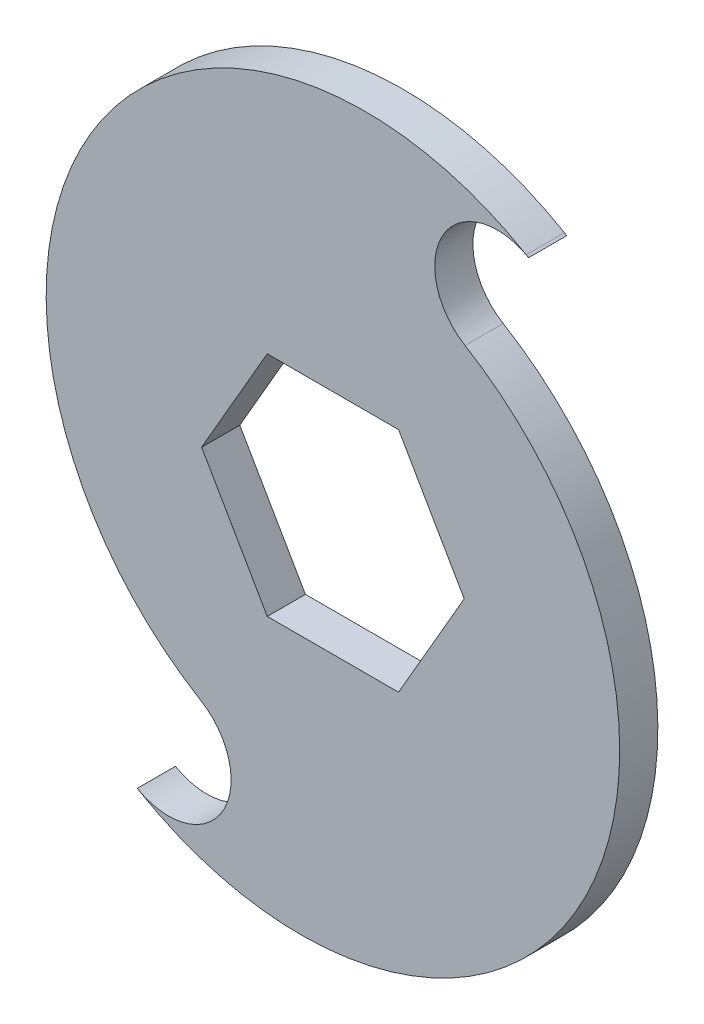
ISO-10303-21;
HEADER;
FILE_DESCRIPTION(('STEP AP214'),'2;1');
FILE_NAME('part.step','',(''),(''),'','','');
FILE_SCHEMA(('AUTOMOTIVE_DESIGN { 1 0 10303 214 1 1 1 1 }'));
ENDSEC;
DATA;
#1=APPLICATION_CONTEXT('core data for automotive mechanical design processes');
#2=APPLICATION_PROTOCOL_DEFINITION('international standard','automotive_design',2000,#1);
#3=PRODUCT_CONTEXT('',#1,'mechanical');
#4=PRODUCT('Part','Part','',(#3));
#5=PRODUCT_RELATED_PRODUCT_CATEGORY('part','',(#4));
#6=PRODUCT_DEFINITION_FORMATION('','',#4);
#7=PRODUCT_DEFINITION_CONTEXT('part definition',#1,'design');
#8=PRODUCT_DEFINITION('design','',#6,#7);
#9=PRODUCT_DEFINITION_SHAPE('','',#8);
#10=(LENGTH_UNIT() NAMED_UNIT(*) SI_UNIT(.MILLI.,.METRE.));
#11=(NAMED_UNIT(*) PLANE_ANGLE_UNIT() SI_UNIT($,.RADIAN.));
#12=(NAMED_UNIT(*) SI_UNIT($,.STERADIAN.) SOLID_ANGLE_UNIT());
#13=UNCERTAINTY_MEASURE_WITH_UNIT(LENGTH_MEASURE(1.E-05),#10,'distance_accuracy_value','');
#14=(GEOMETRIC_REPRESENTATION_CONTEXT(3) GLOBAL_UNCERTAINTY_ASSIGNED_CONTEXT((#13)) GLOBAL_UNIT_ASSIGNED_CONTEXT((#10,
#11,#12)) REPRESENTATION_CONTEXT('',''));
#15=CARTESIAN_POINT('',(0.,0.,0.));
#16=DIRECTION('',(0.,0.,1.));
#17=DIRECTION('',(1.,0.,0.));
#18=AXIS2_PLACEMENT_3D('',#15,#16,#17);
#19=CARTESIAN_POINT('',(0.,0.,5.));
#20=DIRECTION('',(0.,0.,1.));
#21=DIRECTION('',(1.,0.,0.));
#22=AXIS2_PLACEMENT_3D('',#19,#20,#21);
#23=PLANE('',#22);
#24=DIRECTION('',(-0.5,0.866025403784439,0.));
#25=VECTOR('',#24,1.);
#26=CARTESIAN_POINT('',(17.2050380218508,0.,5.));
#27=LINE('',#26,#25);
#28=CARTESIAN_POINT('',(17.2050380218508,0.,5.));
#29=VERTEX_POINT('',#28);
#30=CARTESIAN_POINT('',(8.60251901092543,14.9,5.));
#31=VERTEX_POINT('',#30);
#32=EDGE_CURVE('E231',#29,#31,#27,.T.);
#33=ORIENTED_EDGE('',*,*,#32,.F.);
#34=DIRECTION('',(0.5,0.866025403784439,0.));
#35=VECTOR('',#34,1.);
#36=CARTESIAN_POINT('',(8.60251901092543,-14.9,5.));
#37=LINE('',#36,#35);
#38=CARTESIAN_POINT('',(8.60251901092543,-14.9,5.));
#39=VERTEX_POINT('',#38);
#40=EDGE_CURVE('E208',#39,#29,#37,.T.);
#41=ORIENTED_EDGE('',*,*,#40,.F.);
#42=DIRECTION('',(1.,0.,0.));
#43=VECTOR('',#42,1.);
#44=CARTESIAN_POINT('',(-8.60251901092543,-14.9,5.));
#45=LINE('',#44,#43);
#46=CARTESIAN_POINT('',(-8.60251901092543,-14.9,5.));
#47=VERTEX_POINT('',#46);
#48=EDGE_CURVE('E204',#47,#39,#45,.T.);
#49=ORIENTED_EDGE('',*,*,#48,.F.);
#50=DIRECTION('',(0.5,-0.866025403784439,0.));
#51=VECTOR('',#50,1.);
#52=CARTESIAN_POINT('',(-17.2050380218509,0.,5.));
#53=LINE('',#52,#51);
#54=CARTESIAN_POINT('',(-17.2050380218509,0.,5.));
#55=VERTEX_POINT('',#54);
#56=EDGE_CURVE('E224',#55,#47,#53,.T.);
#57=ORIENTED_EDGE('',*,*,#56,.F.);
#58=DIRECTION('',(-0.5,-0.866025403784438,0.));
#59=VECTOR('',#58,1.);
#60=CARTESIAN_POINT('',(-8.60251901092542,14.9,5.));
#61=LINE('',#60,#59);
#62=CARTESIAN_POINT('',(-8.60251901092542,14.9,5.));
#63=VERTEX_POINT('',#62);
#64=EDGE_CURVE('E227',#63,#55,#61,.T.);
#65=ORIENTED_EDGE('',*,*,#64,.F.);
#66=DIRECTION('',(-1.,0.,0.));
#67=VECTOR('',#66,1.);
#68=CARTESIAN_POINT('',(8.60251901092543,14.9,5.));
#69=LINE('',#68,#67);
#70=EDGE_CURVE('E229',#31,#63,#69,.T.);
#71=ORIENTED_EDGE('',*,*,#70,.F.);
#72=EDGE_LOOP('',(#33,#41,#49,#57,#65,#71));
#73=FACE_BOUND('',#72,.T.);
#74=CARTESIAN_POINT('',(0.,0.,5.));
#75=DIRECTION('',(0.,0.,1.));
#76=DIRECTION('',(1.,0.,0.));
#77=AXIS2_PLACEMENT_3D('',#74,#75,#76);
#78=CIRCLE('',#77,50.);
#79=CARTESIAN_POINT('',(25.6379279782671,42.9266426474421,5.));
#80=VERTEX_POINT('',#79);
#81=CARTESIAN_POINT('',(25.3328092556902,43.1074097483811,5.));
#82=VERTEX_POINT('',#81);
#83=EDGE_CURVE('E159',#80,#82,#78,.T.);
#84=ORIENTED_EDGE('',*,*,#83,.T.);
#85=CARTESIAN_POINT('',(4.22474510045706,7.02630521837552,5.));
#86=DIRECTION('',(0.,0.,1.));
#87=DIRECTION('',(1.,0.,0.));
#88=AXIS2_PLACEMENT_3D('',#85,#86,#87);
#89=CIRCLE('',#88,41.8018716864045);
#90=CARTESIAN_POINT('',(-17.3157053236865,-28.7983437263334,5.));
#91=VERTEX_POINT('',#90);
#92=EDGE_CURVE('E144',#82,#91,#89,.T.);
#93=ORIENTED_EDGE('',*,*,#92,.T.);
#94=CARTESIAN_POINT('',(-21.5406059547456,-35.8249183314924,5.));
#95=DIRECTION('',(0.,0.,1.));
#96=DIRECTION('',(1.,0.,0.));
#97=AXIS2_PLACEMENT_3D('',#94,#95,#96);
#98=CIRCLE('',#97,8.19893505427313);
#99=CARTESIAN_POINT('',(-25.6379279782517,-42.9266426474512,5.));
#100=VERTEX_POINT('',#99);
#101=EDGE_CURVE('E153',#100,#91,#98,.T.);
#102=ORIENTED_EDGE('',*,*,#101,.F.);
#103=CARTESIAN_POINT('',(-25.3328092557395,-43.1074097483521,5.));
#104=VERTEX_POINT('',#103);
#105=EDGE_CURVE('E167',#100,#104,#78,.T.);
#106=ORIENTED_EDGE('',*,*,#105,.T.);
#107=CARTESIAN_POINT('',(-4.22474510046013,-7.02630521837368,5.));
#108=DIRECTION('',(0.,0.,1.));
#109=DIRECTION('',(1.,0.,0.));
#110=AXIS2_PLACEMENT_3D('',#107,#108,#109);
#111=CIRCLE('',#110,41.8018716864044);
#112=CARTESIAN_POINT('',(17.315705323699,28.7983437263258,5.));
#113=VERTEX_POINT('',#112);
#114=EDGE_CURVE('E239',#104,#113,#111,.T.);
#115=ORIENTED_EDGE('',*,*,#114,.T.);
#116=CARTESIAN_POINT('',(21.5406059547605,35.8249183314834,5.));
#117=DIRECTION('',(0.,0.,1.));
#118=DIRECTION('',(1.,0.,0.));
#119=AXIS2_PLACEMENT_3D('',#116,#117,#118);
#120=CIRCLE('',#119,8.19893505427318);
#121=EDGE_CURVE('E165',#80,#113,#120,.T.);
#122=ORIENTED_EDGE('',*,*,#121,.F.);
#123=EDGE_LOOP('',(#84,#93,#102,#106,#115,#122));
#124=FACE_BOUND('',#123,.T.);
#125=ADVANCED_FACE('F55',(#73,#124),#23,.T.);
#126=CARTESIAN_POINT('',(0.,0.,0.));
#127=DIRECTION('',(0.,0.,1.));
#128=DIRECTION('',(1.,0.,0.));
#129=AXIS2_PLACEMENT_3D('',#126,#127,#128);
#130=PLANE('',#129);
#131=DIRECTION('',(0.5,0.866025403784439,0.));
#132=VECTOR('',#131,1.);
#133=CARTESIAN_POINT('',(8.60251901092543,-14.9,0.));
#134=LINE('',#133,#132);
#135=CARTESIAN_POINT('',(8.60251901092543,-14.9,0.));
#136=VERTEX_POINT('',#135);
#137=CARTESIAN_POINT('',(17.2050380218508,0.,0.));
#138=VERTEX_POINT('',#137);
#139=EDGE_CURVE('E221',#136,#138,#134,.T.);
#140=ORIENTED_EDGE('',*,*,#139,.T.);
#141=DIRECTION('',(-0.5,0.866025403784439,0.));
#142=VECTOR('',#141,1.);
#143=CARTESIAN_POINT('',(17.2050380218508,0.,0.));
#144=LINE('',#143,#142);
#145=CARTESIAN_POINT('',(8.60251901092543,14.9,0.));
#146=VERTEX_POINT('',#145);
#147=EDGE_CURVE('E218',#138,#146,#144,.T.);
#148=ORIENTED_EDGE('',*,*,#147,.T.);
#149=DIRECTION('',(-1.,0.,0.));
#150=VECTOR('',#149,1.);
#151=CARTESIAN_POINT('',(8.60251901092543,14.9,0.));
#152=LINE('',#151,#150);
#153=CARTESIAN_POINT('',(-8.60251901092542,14.9,0.));
#154=VERTEX_POINT('',#153);
#155=EDGE_CURVE('E215',#146,#154,#152,.T.);
#156=ORIENTED_EDGE('',*,*,#155,.T.);
#157=DIRECTION('',(-0.5,-0.866025403784438,0.));
#158=VECTOR('',#157,1.);
#159=CARTESIAN_POINT('',(-8.60251901092542,14.9,0.));
#160=LINE('',#159,#158);
#161=CARTESIAN_POINT('',(-17.2050380218509,0.,0.));
#162=VERTEX_POINT('',#161);
#163=EDGE_CURVE('E212',#154,#162,#160,.T.);
#164=ORIENTED_EDGE('',*,*,#163,.T.);
#165=DIRECTION('',(0.5,-0.866025403784439,0.));
#166=VECTOR('',#165,1.);
#167=CARTESIAN_POINT('',(-17.2050380218509,0.,0.));
#168=LINE('',#167,#166);
#169=CARTESIAN_POINT('',(-8.60251901092543,-14.9,0.));
#170=VERTEX_POINT('',#169);
#171=EDGE_CURVE('E209',#162,#170,#168,.T.);
#172=ORIENTED_EDGE('',*,*,#171,.T.);
#173=DIRECTION('',(1.,0.,0.));
#174=VECTOR('',#173,1.);
#175=CARTESIAN_POINT('',(-8.60251901092543,-14.9,0.));
#176=LINE('',#175,#174);
#177=EDGE_CURVE('E205',#170,#136,#176,.T.);
#178=ORIENTED_EDGE('',*,*,#177,.T.);
#179=EDGE_LOOP('',(#140,#148,#156,#164,#172,#178));
#180=FACE_BOUND('',#179,.T.);
#181=CARTESIAN_POINT('',(4.22474510045706,7.02630521837552,0.));
#182=DIRECTION('',(0.,0.,1.));
#183=DIRECTION('',(1.,0.,0.));
#184=AXIS2_PLACEMENT_3D('',#181,#182,#183);
#185=CIRCLE('',#184,41.8018716864045);
#186=CARTESIAN_POINT('',(25.3328092556902,43.1074097483811,0.));
#187=VERTEX_POINT('',#186);
#188=CARTESIAN_POINT('',(-17.3157053236865,-28.7983437263334,0.));
#189=VERTEX_POINT('',#188);
#190=EDGE_CURVE('E241',#187,#189,#185,.T.);
#191=ORIENTED_EDGE('',*,*,#190,.F.);
#192=CARTESIAN_POINT('',(0.,0.,0.));
#193=DIRECTION('',(0.,0.,1.));
#194=DIRECTION('',(1.,0.,0.));
#195=AXIS2_PLACEMENT_3D('',#192,#193,#194);
#196=CIRCLE('',#195,50.);
#197=CARTESIAN_POINT('',(25.6379279782671,42.926642647442,0.));
#198=VERTEX_POINT('',#197);
#199=EDGE_CURVE('E161',#198,#187,#196,.T.);
#200=ORIENTED_EDGE('',*,*,#199,.F.);
#201=CARTESIAN_POINT('',(21.5406059547605,35.8249183314834,0.));
#202=DIRECTION('',(0.,0.,1.));
#203=DIRECTION('',(1.,0.,0.));
#204=AXIS2_PLACEMENT_3D('',#201,#202,#203);
#205=CIRCLE('',#204,8.19893505427318);
#206=CARTESIAN_POINT('',(17.315705323699,28.7983437263258,0.));
#207=VERTEX_POINT('',#206);
#208=EDGE_CURVE('E78',#198,#207,#205,.T.);
#209=ORIENTED_EDGE('',*,*,#208,.T.);
#210=CARTESIAN_POINT('',(-4.22474510046013,-7.02630521837368,0.));
#211=DIRECTION('',(0.,0.,1.));
#212=DIRECTION('',(1.,0.,0.));
#213=AXIS2_PLACEMENT_3D('',#210,#211,#212);
#214=CIRCLE('',#213,41.8018716864044);
#215=CARTESIAN_POINT('',(-25.3328092557395,-43.1074097483521,0.));
#216=VERTEX_POINT('',#215);
#217=EDGE_CURVE('E185',#216,#207,#214,.T.);
#218=ORIENTED_EDGE('',*,*,#217,.F.);
#219=CARTESIAN_POINT('',(-25.6379279782517,-42.9266426474512,0.));
#220=VERTEX_POINT('',#219);
#221=EDGE_CURVE('E175',#220,#216,#196,.T.);
#222=ORIENTED_EDGE('',*,*,#221,.F.);
#223=CARTESIAN_POINT('',(-21.5406059547456,-35.8249183314924,0.));
#224=DIRECTION('',(0.,0.,1.));
#225=DIRECTION('',(1.,0.,0.));
#226=AXIS2_PLACEMENT_3D('',#223,#224,#225);
#227=CIRCLE('',#226,8.19893505427313);
#228=EDGE_CURVE('E70',#220,#189,#227,.T.);
#229=ORIENTED_EDGE('',*,*,#228,.T.);
#230=EDGE_LOOP('',(#191,#200,#209,#218,#222,#229));
#231=FACE_BOUND('',#230,.T.);
#232=ADVANCED_FACE('F184',(#180,#231),#130,.F.);
#233=CARTESIAN_POINT('',(0.,0.,5.));
#234=DIRECTION('',(0.,0.,-1.));
#235=DIRECTION('',(-1.,0.,0.));
#236=AXIS2_PLACEMENT_3D('',#233,#234,#235);
#237=CYLINDRICAL_SURFACE('',#236,50.);
#238=DIRECTION('',(0.,0.,1.));
#239=VECTOR('',#238,1.);
#240=CARTESIAN_POINT('',(25.3328092556902,43.1074097483811,0.));
#241=LINE('',#240,#239);
#242=EDGE_CURVE('E12',#82,#187,#241,.F.);
#243=ORIENTED_EDGE('',*,*,#242,.F.);
#244=ORIENTED_EDGE('',*,*,#83,.F.);
#245=DIRECTION('',(0.,0.,1.));
#246=VECTOR('',#245,1.);
#247=CARTESIAN_POINT('',(25.6379279782671,42.926642647442,0.));
#248=LINE('',#247,#246);
#249=EDGE_CURVE('E166',#80,#198,#248,.F.);
#250=ORIENTED_EDGE('',*,*,#249,.T.);
#251=ORIENTED_EDGE('',*,*,#199,.T.);
#252=EDGE_LOOP('',(#243,#244,#250,#251));
#253=FACE_BOUND('',#252,.T.);
#254=ADVANCED_FACE('F158',(#253),#237,.T.);
#255=ORIENTED_EDGE('',*,*,#105,.F.);
#256=DIRECTION('',(0.,0.,1.));
#257=VECTOR('',#256,1.);
#258=CARTESIAN_POINT('',(-25.6379279782517,-42.9266426474512,2.5));
#259=LINE('',#258,#257);
#260=EDGE_CURVE('E63',#100,#220,#259,.F.);
#261=ORIENTED_EDGE('',*,*,#260,.T.);
#262=ORIENTED_EDGE('',*,*,#221,.T.);
#263=DIRECTION('',(0.,0.,1.));
#264=VECTOR('',#263,1.);
#265=CARTESIAN_POINT('',(-25.3328092557395,-43.1074097483521,0.));
#266=LINE('',#265,#264);
#267=EDGE_CURVE('E169',#104,#216,#266,.F.);
#268=ORIENTED_EDGE('',*,*,#267,.F.);
#269=EDGE_LOOP('',(#255,#261,#262,#268));
#270=FACE_BOUND('',#269,.T.);
#271=ADVANCED_FACE('F57',(#270),#237,.T.);
#272=CARTESIAN_POINT('',(8.60251901092543,-14.9,5.));
#273=DIRECTION('',(-0.866025403784439,0.5,0.));
#274=DIRECTION('',(-0.5,-0.866025403784439,0.));
#275=AXIS2_PLACEMENT_3D('',#272,#273,#274);
#276=PLANE('',#275);
#277=ORIENTED_EDGE('',*,*,#139,.F.);
#278=DIRECTION('',(0.,0.,-1.));
#279=VECTOR('',#278,1.);
#280=CARTESIAN_POINT('',(8.60251901092543,-14.9,5.));
#281=LINE('',#280,#279);
#282=EDGE_CURVE('E201',#39,#136,#281,.T.);
#283=ORIENTED_EDGE('',*,*,#282,.F.);
#284=ORIENTED_EDGE('',*,*,#40,.T.);
#285=DIRECTION('',(0.,0.,-1.));
#286=VECTOR('',#285,1.);
#287=CARTESIAN_POINT('',(17.2050380218508,0.,5.));
#288=LINE('',#287,#286);
#289=EDGE_CURVE('E173',#29,#138,#288,.T.);
#290=ORIENTED_EDGE('',*,*,#289,.T.);
#291=EDGE_LOOP('',(#277,#283,#284,#290));
#292=FACE_BOUND('',#291,.T.);
#293=ADVANCED_FACE('F268',(#292),#276,.T.);
#294=CARTESIAN_POINT('',(17.2050380218508,0.,5.));
#295=DIRECTION('',(-0.866025403784439,-0.5,0.));
#296=DIRECTION('',(0.5,-0.866025403784439,0.));
#297=AXIS2_PLACEMENT_3D('',#294,#295,#296);
#298=PLANE('',#297);
#299=ORIENTED_EDGE('',*,*,#147,.F.);
#300=ORIENTED_EDGE('',*,*,#289,.F.);
#301=ORIENTED_EDGE('',*,*,#32,.T.);
#302=DIRECTION('',(0.,0.,-1.));
#303=VECTOR('',#302,1.);
#304=CARTESIAN_POINT('',(8.60251901092543,14.9,5.));
#305=LINE('',#304,#303);
#306=EDGE_CURVE('E187',#31,#146,#305,.T.);
#307=ORIENTED_EDGE('',*,*,#306,.T.);
#308=EDGE_LOOP('',(#299,#300,#301,#307));
#309=FACE_BOUND('',#308,.T.);
#310=ADVANCED_FACE('F271',(#309),#298,.T.);
#311=CARTESIAN_POINT('',(8.60251901092543,14.9,5.));
#312=DIRECTION('',(0.,-1.,0.));
#313=DIRECTION('',(1.,0.,0.));
#314=AXIS2_PLACEMENT_3D('',#311,#312,#313);
#315=PLANE('',#314);
#316=ORIENTED_EDGE('',*,*,#155,.F.);
#317=ORIENTED_EDGE('',*,*,#306,.F.);
#318=ORIENTED_EDGE('',*,*,#70,.T.);
#319=DIRECTION('',(0.,0.,-1.));
#320=VECTOR('',#319,1.);
#321=CARTESIAN_POINT('',(-8.60251901092542,14.9,5.));
#322=LINE('',#321,#320);
#323=EDGE_CURVE('E191',#63,#154,#322,.T.);
#324=ORIENTED_EDGE('',*,*,#323,.T.);
#325=EDGE_LOOP('',(#316,#317,#318,#324));
#326=FACE_BOUND('',#325,.T.);
#327=ADVANCED_FACE('F274',(#326),#315,.T.);
#328=CARTESIAN_POINT('',(-8.60251901092542,14.9,5.));
#329=DIRECTION('',(0.866025403784438,-0.5,0.));
#330=DIRECTION('',(0.5,0.866025403784438,0.));
#331=AXIS2_PLACEMENT_3D('',#328,#329,#330);
#332=PLANE('',#331);
#333=ORIENTED_EDGE('',*,*,#163,.F.);
#334=ORIENTED_EDGE('',*,*,#323,.F.);
#335=ORIENTED_EDGE('',*,*,#64,.T.);
#336=DIRECTION('',(0.,0.,-1.));
#337=VECTOR('',#336,1.);
#338=CARTESIAN_POINT('',(-17.2050380218509,0.,5.));
#339=LINE('',#338,#337);
#340=EDGE_CURVE('E195',#55,#162,#339,.T.);
#341=ORIENTED_EDGE('',*,*,#340,.T.);
#342=EDGE_LOOP('',(#333,#334,#335,#341));
#343=FACE_BOUND('',#342,.T.);
#344=ADVANCED_FACE('F277',(#343),#332,.T.);
#345=CARTESIAN_POINT('',(-17.2050380218509,0.,5.));
#346=DIRECTION('',(0.866025403784439,0.5,0.));
#347=DIRECTION('',(-0.5,0.866025403784439,0.));
#348=AXIS2_PLACEMENT_3D('',#345,#346,#347);
#349=PLANE('',#348);
#350=ORIENTED_EDGE('',*,*,#171,.F.);
#351=ORIENTED_EDGE('',*,*,#340,.F.);
#352=ORIENTED_EDGE('',*,*,#56,.T.);
#353=DIRECTION('',(0.,0.,-1.));
#354=VECTOR('',#353,1.);
#355=CARTESIAN_POINT('',(-8.60251901092543,-14.9,5.));
#356=LINE('',#355,#354);
#357=EDGE_CURVE('E199',#47,#170,#356,.T.);
#358=ORIENTED_EDGE('',*,*,#357,.T.);
#359=EDGE_LOOP('',(#350,#351,#352,#358));
#360=FACE_BOUND('',#359,.T.);
#361=ADVANCED_FACE('F281',(#360),#349,.T.);
#362=CARTESIAN_POINT('',(-8.60251901092543,-14.9,5.));
#363=DIRECTION('',(0.,1.,0.));
#364=DIRECTION('',(0.,0.,1.));
#365=AXIS2_PLACEMENT_3D('',#362,#363,#364);
#366=PLANE('',#365);
#367=ORIENTED_EDGE('',*,*,#177,.F.);
#368=ORIENTED_EDGE('',*,*,#357,.F.);
#369=ORIENTED_EDGE('',*,*,#48,.T.);
#370=ORIENTED_EDGE('',*,*,#282,.T.);
#371=EDGE_LOOP('',(#367,#368,#369,#370));
#372=FACE_BOUND('',#371,.T.);
#373=ADVANCED_FACE('F257',(#372),#366,.T.);
#374=CARTESIAN_POINT('',(-4.22474510046013,-7.02630521837368,-5.));
#375=DIRECTION('',(0.,0.,1.));
#376=DIRECTION('',(1.,0.,0.));
#377=AXIS2_PLACEMENT_3D('',#374,#375,#376);
#378=CYLINDRICAL_SURFACE('',#377,41.8018716864044);
#379=ORIENTED_EDGE('',*,*,#217,.T.);
#380=DIRECTION('',(0.,0.,1.));
#381=VECTOR('',#380,1.);
#382=CARTESIAN_POINT('',(17.315705323699,28.7983437263258,-5.));
#383=LINE('',#382,#381);
#384=EDGE_CURVE('E236',#207,#113,#383,.T.);
#385=ORIENTED_EDGE('',*,*,#384,.T.);
#386=ORIENTED_EDGE('',*,*,#114,.F.);
#387=ORIENTED_EDGE('',*,*,#267,.T.);
#388=EDGE_LOOP('',(#379,#385,#386,#387));
#389=FACE_BOUND('',#388,.T.);
#390=ADVANCED_FACE('F248',(#389),#378,.T.);
#391=CARTESIAN_POINT('',(21.5406059547605,35.8249183314834,-5.));
#392=DIRECTION('',(0.,0.,1.));
#393=DIRECTION('',(1.,0.,0.));
#394=AXIS2_PLACEMENT_3D('',#391,#392,#393);
#395=CYLINDRICAL_SURFACE('',#394,8.19893505427318);
#396=ORIENTED_EDGE('',*,*,#249,.F.);
#397=ORIENTED_EDGE('',*,*,#121,.T.);
#398=ORIENTED_EDGE('',*,*,#384,.F.);
#399=ORIENTED_EDGE('',*,*,#208,.F.);
#400=EDGE_LOOP('',(#396,#397,#398,#399));
#401=FACE_BOUND('',#400,.T.);
#402=ADVANCED_FACE('F249',(#401),#395,.F.);
#403=CARTESIAN_POINT('',(4.22474510045706,7.02630521837552,-5.));
#404=DIRECTION('',(0.,0.,1.));
#405=DIRECTION('',(1.,0.,0.));
#406=AXIS2_PLACEMENT_3D('',#403,#404,#405);
#407=CYLINDRICAL_SURFACE('',#406,41.8018716864045);
#408=ORIENTED_EDGE('',*,*,#190,.T.);
#409=DIRECTION('',(0.,0.,1.));
#410=VECTOR('',#409,1.);
#411=CARTESIAN_POINT('',(-17.3157053236865,-28.7983437263334,-5.));
#412=LINE('',#411,#410);
#413=EDGE_CURVE('E148',#189,#91,#412,.T.);
#414=ORIENTED_EDGE('',*,*,#413,.T.);
#415=ORIENTED_EDGE('',*,*,#92,.F.);
#416=ORIENTED_EDGE('',*,*,#242,.T.);
#417=EDGE_LOOP('',(#408,#414,#415,#416));
#418=FACE_BOUND('',#417,.T.);
#419=ADVANCED_FACE('F146',(#418),#407,.T.);
#420=CARTESIAN_POINT('',(-21.5406059547456,-35.8249183314924,-5.));
#421=DIRECTION('',(0.,0.,1.));
#422=DIRECTION('',(1.,0.,0.));
#423=AXIS2_PLACEMENT_3D('',#420,#421,#422);
#424=CYLINDRICAL_SURFACE('',#423,8.19893505427313);
#425=ORIENTED_EDGE('',*,*,#260,.F.);
#426=ORIENTED_EDGE('',*,*,#101,.T.);
#427=ORIENTED_EDGE('',*,*,#413,.F.);
#428=ORIENTED_EDGE('',*,*,#228,.F.);
#429=EDGE_LOOP('',(#425,#426,#427,#428));
#430=FACE_BOUND('',#429,.T.);
#431=ADVANCED_FACE('F245',(#430),#424,.F.);
#432=CLOSED_SHELL('',(#125,#232,#254,#271,#293,#310,#327,#344,#361,#373,#390,#402,#419,#431));
#433=MANIFOLD_SOLID_BREP('B2',#432);
#434=ADVANCED_BREP_SHAPE_REPRESENTATION('',(#18,#433),#14);
#435=SHAPE_DEFINITION_REPRESENTATION(#9,#434);
ENDSEC;
END-ISO-10303-21;
